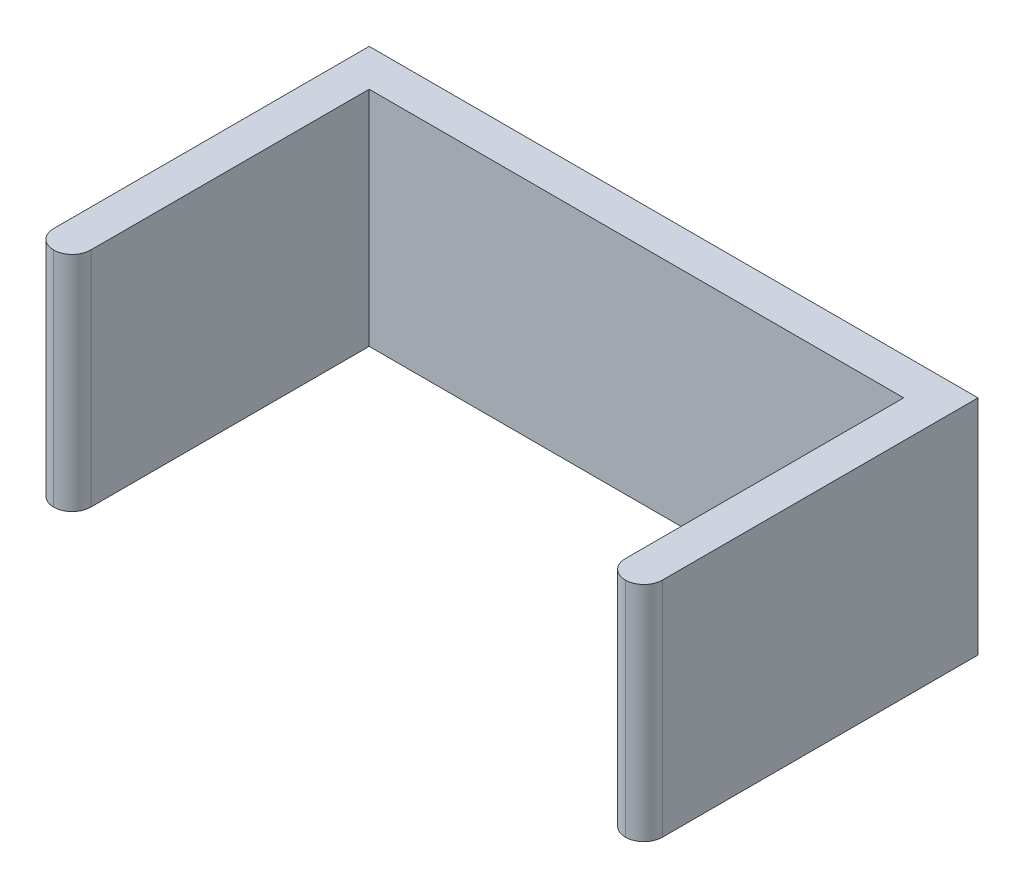
ISO-10303-21;
HEADER;
FILE_DESCRIPTION(('STEP AP214'),'2;1');
FILE_NAME('part.step','',(''),(''),'','','');
FILE_SCHEMA(('AUTOMOTIVE_DESIGN { 1 0 10303 214 1 1 1 1 }'));
ENDSEC;
DATA;
#1=APPLICATION_CONTEXT('core data for automotive mechanical design processes');
#2=APPLICATION_PROTOCOL_DEFINITION('international standard','automotive_design',2000,#1);
#3=PRODUCT_CONTEXT('',#1,'mechanical');
#4=PRODUCT('Part','Part','',(#3));
#5=PRODUCT_RELATED_PRODUCT_CATEGORY('part','',(#4));
#6=PRODUCT_DEFINITION_FORMATION('','',#4);
#7=PRODUCT_DEFINITION_CONTEXT('part definition',#1,'design');
#8=PRODUCT_DEFINITION('design','',#6,#7);
#9=PRODUCT_DEFINITION_SHAPE('','',#8);
#10=(LENGTH_UNIT() NAMED_UNIT(*) SI_UNIT(.MILLI.,.METRE.));
#11=(NAMED_UNIT(*) PLANE_ANGLE_UNIT() SI_UNIT($,.RADIAN.));
#12=(NAMED_UNIT(*) SI_UNIT($,.STERADIAN.) SOLID_ANGLE_UNIT());
#13=UNCERTAINTY_MEASURE_WITH_UNIT(LENGTH_MEASURE(1.E-05),#10,'distance_accuracy_value','');
#14=(GEOMETRIC_REPRESENTATION_CONTEXT(3) GLOBAL_UNCERTAINTY_ASSIGNED_CONTEXT((#13)) GLOBAL_UNIT_ASSIGNED_CONTEXT((#10,
#11,#12)) REPRESENTATION_CONTEXT('',''));
#15=CARTESIAN_POINT('',(0.,0.,0.));
#16=DIRECTION('',(0.,0.,1.));
#17=DIRECTION('',(1.,0.,0.));
#18=AXIS2_PLACEMENT_3D('',#15,#16,#17);
#19=CARTESIAN_POINT('',(0.,0.,5.));
#20=DIRECTION('',(0.,0.,1.));
#21=DIRECTION('',(1.,0.,0.));
#22=AXIS2_PLACEMENT_3D('',#19,#20,#21);
#23=PLANE('',#22);
#24=DIRECTION('',(1.,0.,0.));
#25=VECTOR('',#24,1.);
#26=CARTESIAN_POINT('',(-32.4650713501646,-10.2,5.));
#27=LINE('',#26,#25);
#28=CARTESIAN_POINT('',(-27.4650713501646,-10.2,5.));
#29=VERTEX_POINT('',#28);
#30=CARTESIAN_POINT('',(44.5349286498354,-10.2,5.));
#31=VERTEX_POINT('',#30);
#32=EDGE_CURVE('E142',#29,#31,#27,.T.);
#33=ORIENTED_EDGE('',*,*,#32,.T.);
#34=DIRECTION('',(0.,-1.,0.));
#35=VECTOR('',#34,1.);
#36=CARTESIAN_POINT('',(44.5349286498354,19.8,5.));
#37=LINE('',#36,#35);
#38=CARTESIAN_POINT('',(44.5349286498354,19.8,5.));
#39=VERTEX_POINT('',#38);
#40=EDGE_CURVE('E139',#39,#31,#37,.T.);
#41=ORIENTED_EDGE('',*,*,#40,.F.);
#42=DIRECTION('',(-1.,0.,0.));
#43=VECTOR('',#42,1.);
#44=CARTESIAN_POINT('',(-32.4650713501646,19.8,5.));
#45=LINE('',#44,#43);
#46=CARTESIAN_POINT('',(-27.4650713501646,19.8,5.));
#47=VERTEX_POINT('',#46);
#48=EDGE_CURVE('E123',#39,#47,#45,.T.);
#49=ORIENTED_EDGE('',*,*,#48,.T.);
#50=DIRECTION('',(0.,1.,0.));
#51=VECTOR('',#50,1.);
#52=CARTESIAN_POINT('',(-27.4650713501646,19.8,5.));
#53=LINE('',#52,#51);
#54=EDGE_CURVE('E131',#29,#47,#53,.T.);
#55=ORIENTED_EDGE('',*,*,#54,.F.);
#56=EDGE_LOOP('',(#33,#41,#49,#55));
#57=FACE_BOUND('',#56,.T.);
#58=ADVANCED_FACE('F40',(#57),#23,.T.);
#59=CARTESIAN_POINT('',(-32.4650713501646,19.8,5.));
#60=DIRECTION('',(1.,0.,0.));
#61=DIRECTION('',(0.,1.,0.));
#62=AXIS2_PLACEMENT_3D('',#59,#60,#61);
#63=PLANE('',#62);
#64=DIRECTION('',(0.,0.,-1.));
#65=VECTOR('',#64,1.);
#66=CARTESIAN_POINT('',(-32.4650713501646,-10.2,5.));
#67=LINE('',#66,#65);
#68=CARTESIAN_POINT('',(-32.4650713501646,-10.2,42.5));
#69=VERTEX_POINT('',#68);
#70=CARTESIAN_POINT('',(-32.4650713501646,-10.2,0.));
#71=VERTEX_POINT('',#70);
#72=EDGE_CURVE('E181',#69,#71,#67,.T.);
#73=ORIENTED_EDGE('',*,*,#72,.F.);
#74=DIRECTION('',(0.,-1.,0.));
#75=VECTOR('',#74,1.);
#76=CARTESIAN_POINT('',(-32.4650713501646,19.8,42.5));
#77=LINE('',#76,#75);
#78=CARTESIAN_POINT('',(-32.4650713501646,19.8,42.5));
#79=VERTEX_POINT('',#78);
#80=EDGE_CURVE('E209',#69,#79,#77,.F.);
#81=ORIENTED_EDGE('',*,*,#80,.T.);
#82=DIRECTION('',(0.,0.,-1.));
#83=VECTOR('',#82,1.);
#84=CARTESIAN_POINT('',(-32.4650713501646,19.8,5.));
#85=LINE('',#84,#83);
#86=CARTESIAN_POINT('',(-32.4650713501646,19.8,0.));
#87=VERTEX_POINT('',#86);
#88=EDGE_CURVE('E141',#79,#87,#85,.T.);
#89=ORIENTED_EDGE('',*,*,#88,.T.);
#90=DIRECTION('',(0.,-1.,0.));
#91=VECTOR('',#90,1.);
#92=CARTESIAN_POINT('',(-32.4650713501646,19.8,0.));
#93=LINE('',#92,#91);
#94=EDGE_CURVE('E155',#87,#71,#93,.T.);
#95=ORIENTED_EDGE('',*,*,#94,.T.);
#96=EDGE_LOOP('',(#73,#81,#89,#95));
#97=FACE_BOUND('',#96,.T.);
#98=ADVANCED_FACE('F251',(#97),#63,.F.);
#99=CARTESIAN_POINT('',(-32.4650713501646,-10.2,5.));
#100=DIRECTION('',(0.,1.,0.));
#101=DIRECTION('',(0.,0.,1.));
#102=AXIS2_PLACEMENT_3D('',#99,#100,#101);
#103=PLANE('',#102);
#104=DIRECTION('',(0.,0.,-1.));
#105=VECTOR('',#104,1.);
#106=CARTESIAN_POINT('',(49.5349286498354,-10.2,5.));
#107=LINE('',#106,#105);
#108=CARTESIAN_POINT('',(49.5349286498354,-10.2,42.5));
#109=VERTEX_POINT('',#108);
#110=CARTESIAN_POINT('',(49.5349286498354,-10.2,0.));
#111=VERTEX_POINT('',#110);
#112=EDGE_CURVE('E178',#109,#111,#107,.T.);
#113=ORIENTED_EDGE('',*,*,#112,.F.);
#114=CARTESIAN_POINT('',(47.0349286498354,-10.2,42.5));
#115=DIRECTION('',(0.,1.,0.));
#116=DIRECTION('',(0.,0.,1.));
#117=AXIS2_PLACEMENT_3D('',#114,#115,#116);
#118=CIRCLE('',#117,2.5);
#119=CARTESIAN_POINT('',(47.0349286498354,-10.2,45.));
#120=VERTEX_POINT('',#119);
#121=EDGE_CURVE('E206',#109,#120,#118,.F.);
#122=ORIENTED_EDGE('',*,*,#121,.T.);
#123=CARTESIAN_POINT('',(47.0349286498354,-10.2,42.5));
#124=DIRECTION('',(0.,1.,0.));
#125=DIRECTION('',(0.,0.,1.));
#126=AXIS2_PLACEMENT_3D('',#123,#124,#125);
#127=CIRCLE('',#126,2.5);
#128=CARTESIAN_POINT('',(44.5349286498354,-10.2,42.5));
#129=VERTEX_POINT('',#128);
#130=EDGE_CURVE('E203',#120,#129,#127,.F.);
#131=ORIENTED_EDGE('',*,*,#130,.T.);
#132=DIRECTION('',(0.,0.,-1.));
#133=VECTOR('',#132,1.);
#134=CARTESIAN_POINT('',(44.5349286498354,-10.2,45.));
#135=LINE('',#134,#133);
#136=EDGE_CURVE('E149',#129,#31,#135,.T.);
#137=ORIENTED_EDGE('',*,*,#136,.T.);
#138=ORIENTED_EDGE('',*,*,#32,.F.);
#139=DIRECTION('',(0.,0.,-1.));
#140=VECTOR('',#139,1.);
#141=CARTESIAN_POINT('',(-27.4650713501646,-10.2,45.));
#142=LINE('',#141,#140);
#143=CARTESIAN_POINT('',(-27.4650713501646,-10.2,42.5));
#144=VERTEX_POINT('',#143);
#145=EDGE_CURVE('E130',#144,#29,#142,.T.);
#146=ORIENTED_EDGE('',*,*,#145,.F.);
#147=CARTESIAN_POINT('',(-29.9650713501646,-10.2,42.5));
#148=DIRECTION('',(0.,1.,0.));
#149=DIRECTION('',(0.,0.,1.));
#150=AXIS2_PLACEMENT_3D('',#147,#148,#149);
#151=CIRCLE('',#150,2.5);
#152=CARTESIAN_POINT('',(-29.9650713501646,-10.2,45.));
#153=VERTEX_POINT('',#152);
#154=EDGE_CURVE('E63',#144,#153,#151,.F.);
#155=ORIENTED_EDGE('',*,*,#154,.T.);
#156=CARTESIAN_POINT('',(-29.9650713501646,-10.2,42.5));
#157=DIRECTION('',(0.,1.,0.));
#158=DIRECTION('',(0.,0.,1.));
#159=AXIS2_PLACEMENT_3D('',#156,#157,#158);
#160=CIRCLE('',#159,2.5);
#161=EDGE_CURVE('E58',#153,#69,#160,.F.);
#162=ORIENTED_EDGE('',*,*,#161,.T.);
#163=ORIENTED_EDGE('',*,*,#72,.T.);
#164=DIRECTION('',(1.,0.,0.));
#165=VECTOR('',#164,1.);
#166=CARTESIAN_POINT('',(-32.4650713501646,-10.2,0.));
#167=LINE('',#166,#165);
#168=EDGE_CURVE('E162',#71,#111,#167,.T.);
#169=ORIENTED_EDGE('',*,*,#168,.T.);
#170=EDGE_LOOP('',(#113,#122,#131,#137,#138,#146,#155,#162,#163,#169));
#171=FACE_BOUND('',#170,.T.);
#172=ADVANCED_FACE('F229',(#171),#103,.F.);
#173=CARTESIAN_POINT('',(49.5349286498354,19.8,5.));
#174=DIRECTION('',(-1.,0.,0.));
#175=DIRECTION('',(0.,-1.,0.));
#176=AXIS2_PLACEMENT_3D('',#173,#174,#175);
#177=PLANE('',#176);
#178=DIRECTION('',(0.,0.,-1.));
#179=VECTOR('',#178,1.);
#180=CARTESIAN_POINT('',(49.5349286498354,19.8,5.));
#181=LINE('',#180,#179);
#182=CARTESIAN_POINT('',(49.5349286498354,19.8,42.5));
#183=VERTEX_POINT('',#182);
#184=CARTESIAN_POINT('',(49.5349286498354,19.8,0.));
#185=VERTEX_POINT('',#184);
#186=EDGE_CURVE('E175',#183,#185,#181,.T.);
#187=ORIENTED_EDGE('',*,*,#186,.F.);
#188=DIRECTION('',(0.,1.,0.));
#189=VECTOR('',#188,1.);
#190=CARTESIAN_POINT('',(49.5349286498354,19.8,42.5));
#191=LINE('',#190,#189);
#192=EDGE_CURVE('E195',#183,#109,#191,.F.);
#193=ORIENTED_EDGE('',*,*,#192,.T.);
#194=ORIENTED_EDGE('',*,*,#112,.T.);
#195=DIRECTION('',(0.,1.,0.));
#196=VECTOR('',#195,1.);
#197=CARTESIAN_POINT('',(49.5349286498354,19.8,0.));
#198=LINE('',#197,#196);
#199=EDGE_CURVE('E166',#111,#185,#198,.T.);
#200=ORIENTED_EDGE('',*,*,#199,.T.);
#201=EDGE_LOOP('',(#187,#193,#194,#200));
#202=FACE_BOUND('',#201,.T.);
#203=ADVANCED_FACE('F242',(#202),#177,.F.);
#204=CARTESIAN_POINT('',(-32.4650713501646,19.8,5.));
#205=DIRECTION('',(0.,-1.,0.));
#206=DIRECTION('',(0.,0.,-1.));
#207=AXIS2_PLACEMENT_3D('',#204,#205,#206);
#208=PLANE('',#207);
#209=CARTESIAN_POINT('',(47.0349286498354,19.8,42.5));
#210=DIRECTION('',(0.,-1.,0.));
#211=DIRECTION('',(0.,0.,-1.));
#212=AXIS2_PLACEMENT_3D('',#209,#210,#211);
#213=CIRCLE('',#212,2.5);
#214=CARTESIAN_POINT('',(44.5349286498354,19.8,42.5));
#215=VERTEX_POINT('',#214);
#216=CARTESIAN_POINT('',(47.0349286498354,19.8,45.));
#217=VERTEX_POINT('',#216);
#218=EDGE_CURVE('E189',#215,#217,#213,.F.);
#219=ORIENTED_EDGE('',*,*,#218,.T.);
#220=CARTESIAN_POINT('',(47.0349286498354,19.8,42.5));
#221=DIRECTION('',(0.,-1.,0.));
#222=DIRECTION('',(0.,0.,-1.));
#223=AXIS2_PLACEMENT_3D('',#220,#221,#222);
#224=CIRCLE('',#223,2.5);
#225=EDGE_CURVE('E192',#217,#183,#224,.F.);
#226=ORIENTED_EDGE('',*,*,#225,.T.);
#227=ORIENTED_EDGE('',*,*,#186,.T.);
#228=DIRECTION('',(-1.,0.,0.));
#229=VECTOR('',#228,1.);
#230=CARTESIAN_POINT('',(-32.4650713501646,19.8,0.));
#231=LINE('',#230,#229);
#232=EDGE_CURVE('E157',#185,#87,#231,.T.);
#233=ORIENTED_EDGE('',*,*,#232,.T.);
#234=ORIENTED_EDGE('',*,*,#88,.F.);
#235=CARTESIAN_POINT('',(-29.9650713501646,19.8,42.5));
#236=DIRECTION('',(0.,-1.,0.));
#237=DIRECTION('',(0.,0.,-1.));
#238=AXIS2_PLACEMENT_3D('',#235,#236,#237);
#239=CIRCLE('',#238,2.5);
#240=CARTESIAN_POINT('',(-29.9650713501646,19.8,45.));
#241=VERTEX_POINT('',#240);
#242=EDGE_CURVE('E186',#79,#241,#239,.F.);
#243=ORIENTED_EDGE('',*,*,#242,.T.);
#244=CARTESIAN_POINT('',(-29.9650713501646,19.8,42.5));
#245=DIRECTION('',(0.,-1.,0.));
#246=DIRECTION('',(0.,0.,-1.));
#247=AXIS2_PLACEMENT_3D('',#244,#245,#246);
#248=CIRCLE('',#247,2.5);
#249=CARTESIAN_POINT('',(-27.4650713501646,19.8,42.5));
#250=VERTEX_POINT('',#249);
#251=EDGE_CURVE('E125',#241,#250,#248,.F.);
#252=ORIENTED_EDGE('',*,*,#251,.T.);
#253=DIRECTION('',(0.,0.,-1.));
#254=VECTOR('',#253,1.);
#255=CARTESIAN_POINT('',(-27.4650713501646,19.8,45.));
#256=LINE('',#255,#254);
#257=EDGE_CURVE('E119',#250,#47,#256,.T.);
#258=ORIENTED_EDGE('',*,*,#257,.T.);
#259=ORIENTED_EDGE('',*,*,#48,.F.);
#260=DIRECTION('',(0.,0.,-1.));
#261=VECTOR('',#260,1.);
#262=CARTESIAN_POINT('',(44.5349286498354,19.8,45.));
#263=LINE('',#262,#261);
#264=EDGE_CURVE('E146',#215,#39,#263,.T.);
#265=ORIENTED_EDGE('',*,*,#264,.F.);
#266=EDGE_LOOP('',(#219,#226,#227,#233,#234,#243,#252,#258,#259,#265));
#267=FACE_BOUND('',#266,.T.);
#268=ADVANCED_FACE('F121',(#267),#208,.F.);
#269=CARTESIAN_POINT('',(0.,0.,0.));
#270=DIRECTION('',(0.,0.,1.));
#271=DIRECTION('',(1.,0.,0.));
#272=AXIS2_PLACEMENT_3D('',#269,#270,#271);
#273=PLANE('',#272);
#274=ORIENTED_EDGE('',*,*,#94,.F.);
#275=ORIENTED_EDGE('',*,*,#232,.F.);
#276=ORIENTED_EDGE('',*,*,#199,.F.);
#277=ORIENTED_EDGE('',*,*,#168,.F.);
#278=EDGE_LOOP('',(#274,#275,#276,#277));
#279=FACE_BOUND('',#278,.T.);
#280=ADVANCED_FACE('F248',(#279),#273,.F.);
#281=CARTESIAN_POINT('',(-27.4650713501646,19.8,45.));
#282=DIRECTION('',(-1.,0.,0.));
#283=DIRECTION('',(0.,-1.,0.));
#284=AXIS2_PLACEMENT_3D('',#281,#282,#283);
#285=PLANE('',#284);
#286=ORIENTED_EDGE('',*,*,#257,.F.);
#287=DIRECTION('',(0.,1.,0.));
#288=VECTOR('',#287,1.);
#289=CARTESIAN_POINT('',(-27.4650713501646,-10.2,42.5));
#290=LINE('',#289,#288);
#291=EDGE_CURVE('E11',#250,#144,#290,.F.);
#292=ORIENTED_EDGE('',*,*,#291,.T.);
#293=ORIENTED_EDGE('',*,*,#145,.T.);
#294=ORIENTED_EDGE('',*,*,#54,.T.);
#295=EDGE_LOOP('',(#286,#292,#293,#294));
#296=FACE_BOUND('',#295,.T.);
#297=ADVANCED_FACE('F144',(#296),#285,.F.);
#298=CARTESIAN_POINT('',(44.5349286498354,19.8,45.));
#299=DIRECTION('',(1.,0.,0.));
#300=DIRECTION('',(0.,1.,0.));
#301=AXIS2_PLACEMENT_3D('',#298,#299,#300);
#302=PLANE('',#301);
#303=ORIENTED_EDGE('',*,*,#136,.F.);
#304=DIRECTION('',(0.,-1.,0.));
#305=VECTOR('',#304,1.);
#306=CARTESIAN_POINT('',(44.5349286498354,19.8,42.5));
#307=LINE('',#306,#305);
#308=EDGE_CURVE('E50',#129,#215,#307,.F.);
#309=ORIENTED_EDGE('',*,*,#308,.T.);
#310=ORIENTED_EDGE('',*,*,#264,.T.);
#311=ORIENTED_EDGE('',*,*,#40,.T.);
#312=EDGE_LOOP('',(#303,#309,#310,#311));
#313=FACE_BOUND('',#312,.T.);
#314=ADVANCED_FACE('F232',(#313),#302,.F.);
#315=CARTESIAN_POINT('',(47.0349286498354,0.,42.5));
#316=DIRECTION('',(0.,-1.,0.));
#317=DIRECTION('',(1.,0.,0.));
#318=AXIS2_PLACEMENT_3D('',#315,#316,#317);
#319=CYLINDRICAL_SURFACE('',#318,2.5);
#320=ORIENTED_EDGE('',*,*,#308,.F.);
#321=ORIENTED_EDGE('',*,*,#130,.F.);
#322=DIRECTION('',(0.,-1.,0.));
#323=VECTOR('',#322,1.);
#324=CARTESIAN_POINT('',(47.0349286498354,0.,45.));
#325=LINE('',#324,#323);
#326=EDGE_CURVE('E214',#217,#120,#325,.T.);
#327=ORIENTED_EDGE('',*,*,#326,.F.);
#328=ORIENTED_EDGE('',*,*,#218,.F.);
#329=EDGE_LOOP('',(#320,#321,#327,#328));
#330=FACE_BOUND('',#329,.T.);
#331=ADVANCED_FACE('F236',(#330),#319,.T.);
#332=CARTESIAN_POINT('',(47.0349286498354,0.,42.5));
#333=DIRECTION('',(0.,1.,0.));
#334=DIRECTION('',(-1.,0.,0.));
#335=AXIS2_PLACEMENT_3D('',#332,#333,#334);
#336=CYLINDRICAL_SURFACE('',#335,2.5);
#337=ORIENTED_EDGE('',*,*,#121,.F.);
#338=ORIENTED_EDGE('',*,*,#192,.F.);
#339=ORIENTED_EDGE('',*,*,#225,.F.);
#340=ORIENTED_EDGE('',*,*,#326,.T.);
#341=EDGE_LOOP('',(#337,#338,#339,#340));
#342=FACE_BOUND('',#341,.T.);
#343=ADVANCED_FACE('F239',(#342),#336,.T.);
#344=CARTESIAN_POINT('',(-29.9650713501646,0.,42.5));
#345=DIRECTION('',(0.,-1.,0.));
#346=DIRECTION('',(1.,0.,0.));
#347=AXIS2_PLACEMENT_3D('',#344,#345,#346);
#348=CYLINDRICAL_SURFACE('',#347,2.5);
#349=ORIENTED_EDGE('',*,*,#291,.F.);
#350=ORIENTED_EDGE('',*,*,#251,.F.);
#351=DIRECTION('',(0.,1.,0.));
#352=VECTOR('',#351,1.);
#353=CARTESIAN_POINT('',(-29.9650713501646,19.8,45.));
#354=LINE('',#353,#352);
#355=EDGE_CURVE('E44',#153,#241,#354,.T.);
#356=ORIENTED_EDGE('',*,*,#355,.F.);
#357=ORIENTED_EDGE('',*,*,#154,.F.);
#358=EDGE_LOOP('',(#349,#350,#356,#357));
#359=FACE_BOUND('',#358,.T.);
#360=ADVANCED_FACE('F42',(#359),#348,.T.);
#361=CARTESIAN_POINT('',(-29.9650713501646,0.,42.5));
#362=DIRECTION('',(0.,1.,0.));
#363=DIRECTION('',(-1.,0.,0.));
#364=AXIS2_PLACEMENT_3D('',#361,#362,#363);
#365=CYLINDRICAL_SURFACE('',#364,2.5);
#366=ORIENTED_EDGE('',*,*,#242,.F.);
#367=ORIENTED_EDGE('',*,*,#80,.F.);
#368=ORIENTED_EDGE('',*,*,#161,.F.);
#369=ORIENTED_EDGE('',*,*,#355,.T.);
#370=EDGE_LOOP('',(#366,#367,#368,#369));
#371=FACE_BOUND('',#370,.T.);
#372=ADVANCED_FACE('F225',(#371),#365,.T.);
#373=CLOSED_SHELL('',(#58,#98,#172,#203,#268,#280,#297,#314,#331,#343,#360,#372));
#374=MANIFOLD_SOLID_BREP('B2',#373);
#375=ADVANCED_BREP_SHAPE_REPRESENTATION('',(#18,#374),#14);
#376=SHAPE_DEFINITION_REPRESENTATION(#9,#375);
ENDSEC;
END-ISO-10303-21;
